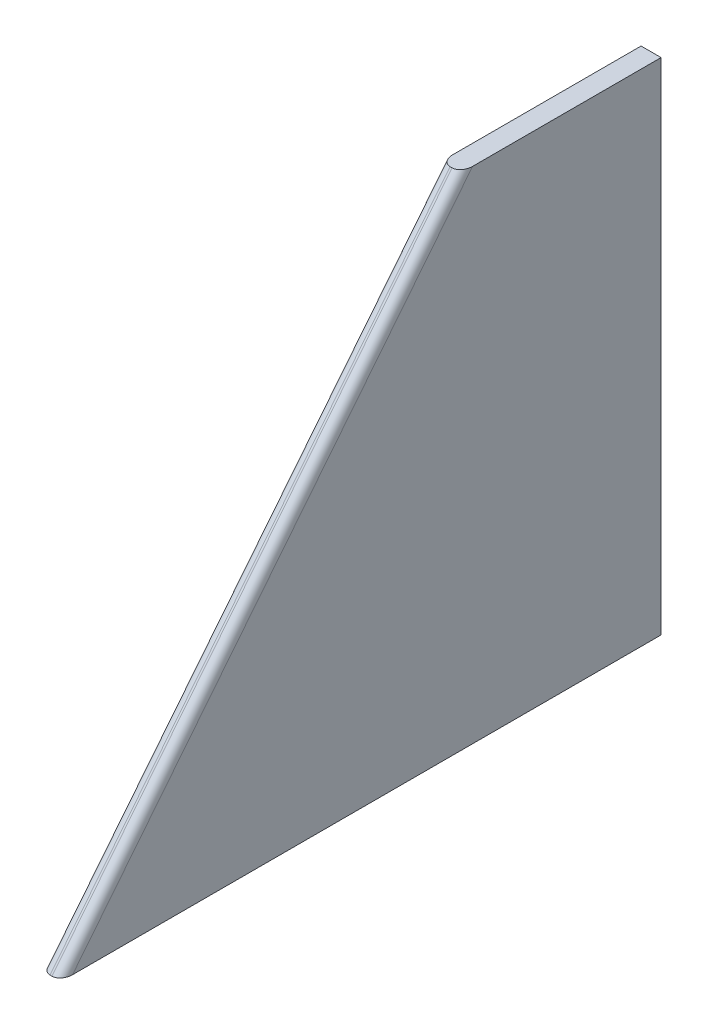
ISO-10303-21;
HEADER;
FILE_DESCRIPTION(('STEP AP214'),'2;1');
FILE_NAME('part.step','',(''),(''),'','','');
FILE_SCHEMA(('AUTOMOTIVE_DESIGN { 1 0 10303 214 1 1 1 1 }'));
ENDSEC;
DATA;
#1=APPLICATION_CONTEXT('core data for automotive mechanical design processes');
#2=APPLICATION_PROTOCOL_DEFINITION('international standard','automotive_design',2000,#1);
#3=PRODUCT_CONTEXT('',#1,'mechanical');
#4=PRODUCT('Part','Part','',(#3));
#5=PRODUCT_RELATED_PRODUCT_CATEGORY('part','',(#4));
#6=PRODUCT_DEFINITION_FORMATION('','',#4);
#7=PRODUCT_DEFINITION_CONTEXT('part definition',#1,'design');
#8=PRODUCT_DEFINITION('design','',#6,#7);
#9=PRODUCT_DEFINITION_SHAPE('','',#8);
#10=(LENGTH_UNIT() NAMED_UNIT(*) SI_UNIT(.MILLI.,.METRE.));
#11=(NAMED_UNIT(*) PLANE_ANGLE_UNIT() SI_UNIT($,.RADIAN.));
#12=(NAMED_UNIT(*) SI_UNIT($,.STERADIAN.) SOLID_ANGLE_UNIT());
#13=UNCERTAINTY_MEASURE_WITH_UNIT(LENGTH_MEASURE(1.E-05),#10,'distance_accuracy_value','');
#14=(GEOMETRIC_REPRESENTATION_CONTEXT(3) GLOBAL_UNCERTAINTY_ASSIGNED_CONTEXT((#13)) GLOBAL_UNIT_ASSIGNED_CONTEXT((#10,
#11,#12)) REPRESENTATION_CONTEXT('',''));
#15=CARTESIAN_POINT('',(0.,0.,0.));
#16=DIRECTION('',(0.,0.,1.));
#17=DIRECTION('',(1.,0.,0.));
#18=AXIS2_PLACEMENT_3D('',#15,#16,#17);
#19=CARTESIAN_POINT('',(1.27,63.5,-50.8));
#20=DIRECTION('',(0.,-0.624695047554424,-0.78086880944303));
#21=DIRECTION('',(0.,0.78086880944303,-0.624695047554424));
#22=AXIS2_PLACEMENT_3D('',#19,#20,#21);
#23=PLANE('',#22);
#24=DIRECTION('',(-1.,0.,0.));
#25=VECTOR('',#24,1.);
#26=CARTESIAN_POINT('',(1.27,63.5,-50.8));
#27=LINE('',#26,#25);
#28=CARTESIAN_POINT('',(0.127,63.5,-50.8));
#29=VERTEX_POINT('',#28);
#30=CARTESIAN_POINT('',(-0.127,63.5,-50.8));
#31=VERTEX_POINT('',#30);
#32=EDGE_CURVE('E123',#29,#31,#27,.T.);
#33=ORIENTED_EDGE('',*,*,#32,.T.);
#34=DIRECTION('',(0.,-0.78086880944303,0.624695047554424));
#35=VECTOR('',#34,1.);
#36=CARTESIAN_POINT('',(-0.127,63.5,-50.8));
#37=LINE('',#36,#35);
#38=CARTESIAN_POINT('',(-0.127,0.,0.));
#39=VERTEX_POINT('',#38);
#40=EDGE_CURVE('E143',#31,#39,#37,.T.);
#41=ORIENTED_EDGE('',*,*,#40,.T.);
#42=DIRECTION('',(-1.,0.,0.));
#43=VECTOR('',#42,1.);
#44=CARTESIAN_POINT('',(1.27,0.,0.));
#45=LINE('',#44,#43);
#46=CARTESIAN_POINT('',(0.127,0.,0.));
#47=VERTEX_POINT('',#46);
#48=EDGE_CURVE('E114',#47,#39,#45,.T.);
#49=ORIENTED_EDGE('',*,*,#48,.F.);
#50=DIRECTION('',(0.,-0.78086880944303,0.624695047554424));
#51=VECTOR('',#50,1.);
#52=CARTESIAN_POINT('',(0.127,63.5,-50.8));
#53=LINE('',#52,#51);
#54=EDGE_CURVE('E140',#47,#29,#53,.F.);
#55=ORIENTED_EDGE('',*,*,#54,.T.);
#56=EDGE_LOOP('',(#33,#41,#49,#55));
#57=FACE_BOUND('',#56,.T.);
#58=ADVANCED_FACE('F38',(#57),#23,.F.);
#59=CARTESIAN_POINT('',(1.27,0.,0.));
#60=DIRECTION('',(0.,1.,0.));
#61=DIRECTION('',(0.,0.,1.));
#62=AXIS2_PLACEMENT_3D('',#59,#60,#61);
#63=PLANE('',#62);
#64=ORIENTED_EDGE('',*,*,#48,.T.);
#65=CARTESIAN_POINT('',(-0.127,0.,-1.46375420067715));
#66=DIRECTION('',(0.,1.,0.));
#67=DIRECTION('',(0.,0.,1.));
#68=AXIS2_PLACEMENT_3D('',#65,#66,#67);
#69=ELLIPSE('',#68,1.46375420067715,1.143);
#70=CARTESIAN_POINT('',(-1.27,0.,-1.46375420067715));
#71=VERTEX_POINT('',#70);
#72=EDGE_CURVE('E150',#39,#71,#69,.F.);
#73=ORIENTED_EDGE('',*,*,#72,.T.);
#74=DIRECTION('',(0.,0.,-1.));
#75=VECTOR('',#74,1.);
#76=CARTESIAN_POINT('',(-1.27,0.,0.));
#77=LINE('',#76,#75);
#78=CARTESIAN_POINT('',(-1.27,0.,-76.2));
#79=VERTEX_POINT('',#78);
#80=EDGE_CURVE('E110',#71,#79,#77,.T.);
#81=ORIENTED_EDGE('',*,*,#80,.T.);
#82=DIRECTION('',(-1.,0.,0.));
#83=VECTOR('',#82,1.);
#84=CARTESIAN_POINT('',(1.27,0.,-76.2));
#85=LINE('',#84,#83);
#86=CARTESIAN_POINT('',(1.27,0.,-76.2));
#87=VERTEX_POINT('',#86);
#88=EDGE_CURVE('E107',#87,#79,#85,.T.);
#89=ORIENTED_EDGE('',*,*,#88,.F.);
#90=DIRECTION('',(0.,0.,-1.));
#91=VECTOR('',#90,1.);
#92=CARTESIAN_POINT('',(1.27,0.,0.));
#93=LINE('',#92,#91);
#94=CARTESIAN_POINT('',(1.27,0.,-1.46375420067715));
#95=VERTEX_POINT('',#94);
#96=EDGE_CURVE('E95',#95,#87,#93,.T.);
#97=ORIENTED_EDGE('',*,*,#96,.F.);
#98=CARTESIAN_POINT('',(0.127,0.,-1.46375420067715));
#99=DIRECTION('',(0.,1.,0.));
#100=DIRECTION('',(0.,0.,-1.));
#101=AXIS2_PLACEMENT_3D('',#98,#99,#100);
#102=ELLIPSE('',#101,1.46375420067715,1.143);
#103=EDGE_CURVE('E147',#95,#47,#102,.F.);
#104=ORIENTED_EDGE('',*,*,#103,.T.);
#105=EDGE_LOOP('',(#64,#73,#81,#89,#97,#104));
#106=FACE_BOUND('',#105,.T.);
#107=ADVANCED_FACE('F109',(#106),#63,.F.);
#108=CARTESIAN_POINT('',(1.27,0.,-76.2));
#109=DIRECTION('',(0.,0.,1.));
#110=DIRECTION('',(0.,-1.,0.));
#111=AXIS2_PLACEMENT_3D('',#108,#109,#110);
#112=PLANE('',#111);
#113=DIRECTION('',(0.,1.,0.));
#114=VECTOR('',#113,1.);
#115=CARTESIAN_POINT('',(-1.27,0.,-76.2));
#116=LINE('',#115,#114);
#117=CARTESIAN_POINT('',(-1.27,63.5,-76.2));
#118=VERTEX_POINT('',#117);
#119=EDGE_CURVE('E128',#79,#118,#116,.T.);
#120=ORIENTED_EDGE('',*,*,#119,.T.);
#121=DIRECTION('',(-1.,0.,0.));
#122=VECTOR('',#121,1.);
#123=CARTESIAN_POINT('',(1.27,63.5,-76.2));
#124=LINE('',#123,#122);
#125=CARTESIAN_POINT('',(1.27,63.5,-76.2));
#126=VERTEX_POINT('',#125);
#127=EDGE_CURVE('E115',#126,#118,#124,.T.);
#128=ORIENTED_EDGE('',*,*,#127,.F.);
#129=DIRECTION('',(0.,1.,0.));
#130=VECTOR('',#129,1.);
#131=CARTESIAN_POINT('',(1.27,0.,-76.2));
#132=LINE('',#131,#130);
#133=EDGE_CURVE('E99',#87,#126,#132,.T.);
#134=ORIENTED_EDGE('',*,*,#133,.F.);
#135=ORIENTED_EDGE('',*,*,#88,.T.);
#136=EDGE_LOOP('',(#120,#128,#134,#135));
#137=FACE_BOUND('',#136,.T.);
#138=ADVANCED_FACE('F117',(#137),#112,.F.);
#139=CARTESIAN_POINT('',(1.27,63.5,-76.2));
#140=DIRECTION('',(0.,-1.,0.));
#141=DIRECTION('',(0.,0.,-1.));
#142=AXIS2_PLACEMENT_3D('',#139,#140,#141);
#143=PLANE('',#142);
#144=DIRECTION('',(0.,0.,1.));
#145=VECTOR('',#144,1.);
#146=CARTESIAN_POINT('',(-1.27,63.5,-76.2));
#147=LINE('',#146,#145);
#148=CARTESIAN_POINT('',(-1.27,63.5,-52.2637542006772));
#149=VERTEX_POINT('',#148);
#150=EDGE_CURVE('E104',#118,#149,#147,.T.);
#151=ORIENTED_EDGE('',*,*,#150,.T.);
#152=CARTESIAN_POINT('',(-0.127,63.5,-52.2637542006772));
#153=DIRECTION('',(0.,-1.,0.));
#154=DIRECTION('',(0.,0.,1.));
#155=AXIS2_PLACEMENT_3D('',#152,#153,#154);
#156=ELLIPSE('',#155,1.46375420067715,1.143);
#157=EDGE_CURVE('E47',#149,#31,#156,.F.);
#158=ORIENTED_EDGE('',*,*,#157,.T.);
#159=ORIENTED_EDGE('',*,*,#32,.F.);
#160=CARTESIAN_POINT('',(0.127,63.5,-52.2637542006772));
#161=DIRECTION('',(0.,-1.,0.));
#162=DIRECTION('',(0.,0.,-1.));
#163=AXIS2_PLACEMENT_3D('',#160,#161,#162);
#164=ELLIPSE('',#163,1.46375420067715,1.143);
#165=CARTESIAN_POINT('',(1.27,63.5,-52.2637542006772));
#166=VERTEX_POINT('',#165);
#167=EDGE_CURVE('E54',#29,#166,#164,.F.);
#168=ORIENTED_EDGE('',*,*,#167,.T.);
#169=DIRECTION('',(0.,0.,1.));
#170=VECTOR('',#169,1.);
#171=CARTESIAN_POINT('',(1.27,63.5,-76.2));
#172=LINE('',#171,#170);
#173=EDGE_CURVE('E120',#126,#166,#172,.T.);
#174=ORIENTED_EDGE('',*,*,#173,.F.);
#175=ORIENTED_EDGE('',*,*,#127,.T.);
#176=EDGE_LOOP('',(#151,#158,#159,#168,#174,#175));
#177=FACE_BOUND('',#176,.T.);
#178=ADVANCED_FACE('F158',(#177),#143,.F.);
#179=CARTESIAN_POINT('',(1.27,0.,0.));
#180=DIRECTION('',(1.,0.,0.));
#181=DIRECTION('',(0.,0.,-1.));
#182=AXIS2_PLACEMENT_3D('',#179,#180,#181);
#183=PLANE('',#182);
#184=ORIENTED_EDGE('',*,*,#173,.T.);
#185=DIRECTION('',(0.,-0.78086880944303,0.624695047554424));
#186=VECTOR('',#185,1.);
#187=CARTESIAN_POINT('',(1.27,-0.714026439354706,-0.892533049193382));
#188=LINE('',#187,#186);
#189=EDGE_CURVE('E11',#166,#95,#188,.T.);
#190=ORIENTED_EDGE('',*,*,#189,.T.);
#191=ORIENTED_EDGE('',*,*,#96,.T.);
#192=ORIENTED_EDGE('',*,*,#133,.T.);
#193=EDGE_LOOP('',(#184,#190,#191,#192));
#194=FACE_BOUND('',#193,.T.);
#195=ADVANCED_FACE('F97',(#194),#183,.T.);
#196=CARTESIAN_POINT('',(-1.27,0.,0.));
#197=DIRECTION('',(1.,0.,0.));
#198=DIRECTION('',(0.,0.,-1.));
#199=AXIS2_PLACEMENT_3D('',#196,#197,#198);
#200=PLANE('',#199);
#201=ORIENTED_EDGE('',*,*,#80,.F.);
#202=DIRECTION('',(0.,-0.78086880944303,0.624695047554424));
#203=VECTOR('',#202,1.);
#204=CARTESIAN_POINT('',(-1.27,-0.714026439354706,-0.892533049193382));
#205=LINE('',#204,#203);
#206=EDGE_CURVE('E62',#71,#149,#205,.F.);
#207=ORIENTED_EDGE('',*,*,#206,.T.);
#208=ORIENTED_EDGE('',*,*,#150,.F.);
#209=ORIENTED_EDGE('',*,*,#119,.F.);
#210=EDGE_LOOP('',(#201,#207,#208,#209));
#211=FACE_BOUND('',#210,.T.);
#212=ADVANCED_FACE('F165',(#211),#200,.F.);
#213=CARTESIAN_POINT('',(-0.127,62.7859735606453,-51.6925330491934));
#214=DIRECTION('',(0.,-0.78086880944303,0.624695047554424));
#215=DIRECTION('',(0.,-0.624695047554424,-0.78086880944303));
#216=AXIS2_PLACEMENT_3D('',#213,#214,#215);
#217=CYLINDRICAL_SURFACE('',#216,1.143);
#218=ORIENTED_EDGE('',*,*,#157,.F.);
#219=ORIENTED_EDGE('',*,*,#206,.F.);
#220=ORIENTED_EDGE('',*,*,#72,.F.);
#221=ORIENTED_EDGE('',*,*,#40,.F.);
#222=EDGE_LOOP('',(#218,#219,#220,#221));
#223=FACE_BOUND('',#222,.T.);
#224=ADVANCED_FACE('F164',(#223),#217,.T.);
#225=CARTESIAN_POINT('',(0.127,-0.714026439354706,-0.892533049193382));
#226=DIRECTION('',(0.,0.78086880944303,-0.624695047554424));
#227=DIRECTION('',(0.,0.624695047554424,0.78086880944303));
#228=AXIS2_PLACEMENT_3D('',#225,#226,#227);
#229=CYLINDRICAL_SURFACE('',#228,1.143);
#230=ORIENTED_EDGE('',*,*,#167,.F.);
#231=ORIENTED_EDGE('',*,*,#54,.F.);
#232=ORIENTED_EDGE('',*,*,#103,.F.);
#233=ORIENTED_EDGE('',*,*,#189,.F.);
#234=EDGE_LOOP('',(#230,#231,#232,#233));
#235=FACE_BOUND('',#234,.T.);
#236=ADVANCED_FACE('F40',(#235),#229,.T.);
#237=CLOSED_SHELL('',(#58,#107,#138,#178,#195,#212,#224,#236));
#238=MANIFOLD_SOLID_BREP('B2',#237);
#239=ADVANCED_BREP_SHAPE_REPRESENTATION('',(#18,#238),#14);
#240=SHAPE_DEFINITION_REPRESENTATION(#9,#239);
ENDSEC;
END-ISO-10303-21;
